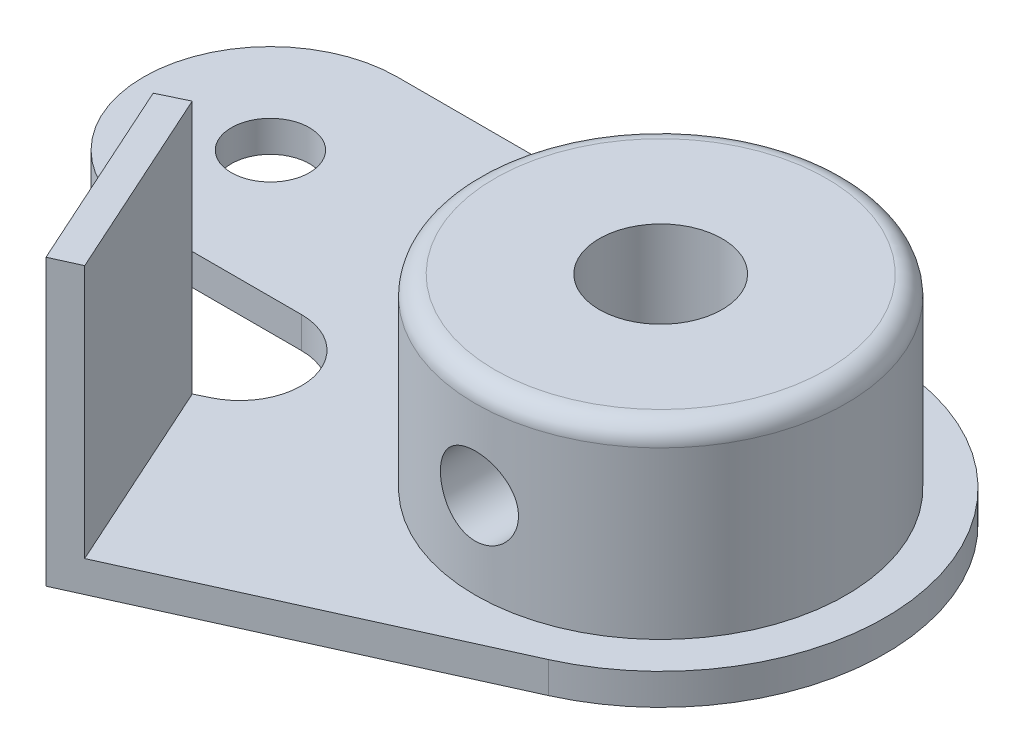
ISO-10303-21;
HEADER;
FILE_DESCRIPTION(('STEP AP214'),'2;1');
FILE_NAME('part.step','',(''),(''),'','','');
FILE_SCHEMA(('AUTOMOTIVE_DESIGN { 1 0 10303 214 1 1 1 1 }'));
ENDSEC;
DATA;
#1=APPLICATION_CONTEXT('core data for automotive mechanical design processes');
#2=APPLICATION_PROTOCOL_DEFINITION('international standard','automotive_design',2000,#1);
#3=PRODUCT_CONTEXT('',#1,'mechanical');
#4=PRODUCT('Part','Part','',(#3));
#5=PRODUCT_RELATED_PRODUCT_CATEGORY('part','',(#4));
#6=PRODUCT_DEFINITION_FORMATION('','',#4);
#7=PRODUCT_DEFINITION_CONTEXT('part definition',#1,'design');
#8=PRODUCT_DEFINITION('design','',#6,#7);
#9=PRODUCT_DEFINITION_SHAPE('','',#8);
#10=(LENGTH_UNIT() NAMED_UNIT(*) SI_UNIT(.MILLI.,.METRE.));
#11=(NAMED_UNIT(*) PLANE_ANGLE_UNIT() SI_UNIT($,.RADIAN.));
#12=(NAMED_UNIT(*) SI_UNIT($,.STERADIAN.) SOLID_ANGLE_UNIT());
#13=UNCERTAINTY_MEASURE_WITH_UNIT(LENGTH_MEASURE(1.E-05),#10,'distance_accuracy_value','');
#14=(GEOMETRIC_REPRESENTATION_CONTEXT(3) GLOBAL_UNCERTAINTY_ASSIGNED_CONTEXT((#13)) GLOBAL_UNIT_ASSIGNED_CONTEXT((#10,
#11,#12)) REPRESENTATION_CONTEXT('',''));
#15=CARTESIAN_POINT('',(0.,0.,0.));
#16=DIRECTION('',(0.,0.,1.));
#17=DIRECTION('',(1.,0.,0.));
#18=AXIS2_PLACEMENT_3D('',#15,#16,#17);
#19=CARTESIAN_POINT('',(0.,1.6,0.));
#20=DIRECTION('',(0.,-1.,0.));
#21=DIRECTION('',(0.,0.,-1.));
#22=AXIS2_PLACEMENT_3D('',#19,#20,#21);
#23=CYLINDRICAL_SURFACE('',#22,3.15);
#24=CARTESIAN_POINT('',(0.,11.1,0.));
#25=DIRECTION('',(0.,1.,0.));
#26=DIRECTION('',(0.,0.,1.));
#27=AXIS2_PLACEMENT_3D('',#24,#25,#26);
#28=CIRCLE('',#27,3.15);
#29=CARTESIAN_POINT('',(0.,11.1,3.15));
#30=VERTEX_POINT('',#29);
#31=EDGE_CURVE('E255',#30,#30,#28,.T.);
#32=ORIENTED_EDGE('',*,*,#31,.T.);
#33=EDGE_LOOP('',(#32));
#34=FACE_BOUND('',#33,.T.);
#35=CARTESIAN_POINT('',(0.,0.,0.));
#36=DIRECTION('',(0.,1.,0.));
#37=DIRECTION('',(0.,0.,1.));
#38=AXIS2_PLACEMENT_3D('',#35,#36,#37);
#39=CIRCLE('',#38,3.15);
#40=CARTESIAN_POINT('',(0.,0.,3.15));
#41=VERTEX_POINT('',#40);
#42=EDGE_CURVE('E148',#41,#41,#39,.T.);
#43=ORIENTED_EDGE('',*,*,#42,.F.);
#44=EDGE_LOOP('',(#43));
#45=FACE_BOUND('',#44,.T.);
#46=CARTESIAN_POINT('',(-2.,6.,2.43361870472759));
#47=CARTESIAN_POINT('',(-1.99999048596303,5.90102207587077,2.43363407140303));
#48=CARTESIAN_POINT('',(-1.99258494171125,5.8019062063151,2.4397712297814));
#49=CARTESIAN_POINT('',(-1.96350941138464,5.60706270821603,2.46321942053438));
#50=CARTESIAN_POINT('',(-1.94180331367139,5.51134430549493,2.48055873835427));
#51=CARTESIAN_POINT('',(-1.88571217682298,5.32670656946432,2.52345220456699));
#52=CARTESIAN_POINT('',(-1.851440143901,5.23773491447205,2.5489328823773));
#53=CARTESIAN_POINT('',(-1.77151743183294,5.06692488180819,2.60511197616351));
#54=CARTESIAN_POINT('',(-1.72586583679141,4.98508707902778,2.6358108120648));
#55=CARTESIAN_POINT('',(-1.61708994740565,4.81836699845349,2.70410628666589));
#56=CARTESIAN_POINT('',(-1.55241882997592,4.73464335498212,2.74206853555775));
#57=CARTESIAN_POINT('',(-1.41059220491435,4.57824562761575,2.81765858361404));
#58=CARTESIAN_POINT('',(-1.33342569379183,4.50558139309569,2.85528605688028));
#59=CARTESIAN_POINT('',(-1.15704034741739,4.36428192092148,2.93157022789516));
#60=CARTESIAN_POINT('',(-1.05626802714094,4.29730784897356,2.96975927399976));
#61=CARTESIAN_POINT('',(-0.841996814394423,4.18181290290956,3.03745228192605));
#62=CARTESIAN_POINT('',(-0.728511029226368,4.13327324596592,3.0669650770146));
#63=CARTESIAN_POINT('',(-0.504499180886491,4.0614865270954,3.11120961521296));
#64=CARTESIAN_POINT('',(-0.394895915515058,4.03613172714355,3.12716069277187));
#65=CARTESIAN_POINT('',(-0.171964548656172,4.00423832870474,3.14728504515542));
#66=CARTESIAN_POINT('',(-0.0586406758425458,3.99767906906348,3.15147125251418));
#67=CARTESIAN_POINT('',(0.151552365513752,4.00337063765575,3.1478620369092));
#68=CARTESIAN_POINT('',(0.248528717658883,4.01314438384651,3.14164430808859));
#69=CARTESIAN_POINT('',(0.439138310744908,4.04640969494782,3.12071260109803));
#70=CARTESIAN_POINT('',(0.532771299038607,4.06990229422963,3.10599798228226));
#71=CARTESIAN_POINT('',(0.71448221653663,4.12952423535327,3.06930433488698));
#72=CARTESIAN_POINT('',(0.802553648932607,4.16566804493043,3.04731699091795));
#73=CARTESIAN_POINT('',(0.971433705071278,4.24922820875193,2.9977610791413));
#74=CARTESIAN_POINT('',(1.05224075549125,4.29664699686879,2.97019130647403));
#75=CARTESIAN_POINT('',(1.21525026488542,4.4081105424623,2.90761365273554));
#76=CARTESIAN_POINT('',(1.29634063387077,4.47349858403209,2.87210613999983));
#77=CARTESIAN_POINT('',(1.44710869319607,4.6155761615265,2.79917994431847));
#78=CARTESIAN_POINT('',(1.51676911567106,4.6922824705496,2.76175847971295));
#79=CARTESIAN_POINT('',(1.65238450119593,4.86708895578629,2.68310715916129));
#80=CARTESIAN_POINT('',(1.71653615599839,4.96668017539723,2.64205458619123));
#81=CARTESIAN_POINT('',(1.82699006644229,5.17767381643497,2.56692053853577));
#82=CARTESIAN_POINT('',(1.87332485499188,5.28905423222767,2.53282641194835));
#83=CARTESIAN_POINT('',(1.93594353840381,5.49006792949197,2.48510313895072));
#84=CARTESIAN_POINT('',(1.95695691453044,5.5775018242823,2.4684365697313));
#85=CARTESIAN_POINT('',(1.98705521670472,5.75558860288065,2.44427838946132));
#86=CARTESIAN_POINT('',(1.99615746158439,5.84623661578726,2.43677345842157));
#87=CARTESIAN_POINT('',(2.00187916764653,6.02845111900768,2.43207683030032));
#88=CARTESIAN_POINT('',(1.99846473948857,6.12001943246775,2.43491313236562));
#89=CARTESIAN_POINT('',(1.97931399694525,6.30102254327303,2.45050151797388));
#90=CARTESIAN_POINT('',(1.96356738826233,6.39045549382134,2.46326188557667));
#91=CARTESIAN_POINT('',(1.92117762173105,6.56283355704784,2.4964515411222));
#92=CARTESIAN_POINT('',(1.89479801639248,6.64588150553575,2.51669442404587));
#93=CARTESIAN_POINT('',(1.83219474854383,6.80653886658106,2.56262885233369));
#94=CARTESIAN_POINT('',(1.79596764397219,6.88414636554851,2.58832230217973));
#95=CARTESIAN_POINT('',(1.70664270614312,7.04769006927012,2.64826132049625));
#96=CARTESIAN_POINT('',(1.65163646925486,7.1323294707201,2.68319953585284));
#97=CARTESIAN_POINT('',(1.52987672919129,7.29212382718042,2.75444460515898));
#98=CARTESIAN_POINT('',(1.46311080446709,7.36726860760888,2.79075287408715));
#99=CARTESIAN_POINT('',(1.30608396864551,7.51922778089847,2.86802362872114));
#100=CARTESIAN_POINT('',(1.21375656890451,7.59407598604232,2.90870266544109));
#101=CARTESIAN_POINT('',(1.01546677917969,7.72715319632718,2.98371307769469));
#102=CARTESIAN_POINT('',(0.909509417054116,7.78538830439131,3.01804678258841));
#103=CARTESIAN_POINT('',(0.692269340715499,7.87990128529792,3.07492813370973));
#104=CARTESIAN_POINT('',(0.581566442490213,7.91717925017158,3.09800396720935));
#105=CARTESIAN_POINT('',(0.353649402796511,7.97195580472325,3.13219438593408));
#106=CARTESIAN_POINT('',(0.236445246049435,7.98948388984159,3.14332680684523));
#107=CARTESIAN_POINT('',(0.0184183325762341,8.00242823691304,3.15154075684456));
#108=CARTESIAN_POINT('',(-0.0821686966634247,8.00081595933269,3.15051062601086));
#109=CARTESIAN_POINT('',(-0.281418451771939,7.98262531510482,3.13898890793604));
#110=CARTESIAN_POINT('',(-0.380081322552779,7.96604807997764,3.12849803603419));
#111=CARTESIAN_POINT('',(-0.568457204796261,7.91986127054207,3.09968712791156));
#112=CARTESIAN_POINT('',(-0.658372613948632,7.89084216408678,3.08172279670887));
#113=CARTESIAN_POINT('',(-0.831943827649842,7.82115957436105,3.03946637750989));
#114=CARTESIAN_POINT('',(-0.915598667382394,7.78049430094183,3.01517331676755));
#115=CARTESIAN_POINT('',(-1.08344928980128,7.68416939821632,2.95926218224012));
#116=CARTESIAN_POINT('',(-1.1668476075888,7.62741068932284,2.92715228253863));
#117=CARTESIAN_POINT('',(-1.32350652343996,7.50278680167161,2.85974121332081));
#118=CARTESIAN_POINT('',(-1.39675588258577,7.43490948882403,2.82443657633822));
#119=CARTESIAN_POINT('',(-1.54245036284827,7.27826060078095,2.74792336709905));
#120=CARTESIAN_POINT('',(-1.61312724346329,7.18788213759843,2.70662345481368));
#121=CARTESIAN_POINT('',(-1.7386221852289,6.99518354718232,2.62777208404518));
#122=CARTESIAN_POINT('',(-1.79344679580487,6.89286837623683,2.59021908172396));
#123=CARTESIAN_POINT('',(-1.87534108446168,6.70106788875551,2.53131778643174));
#124=CARTESIAN_POINT('',(-1.90584854100258,6.61358965355608,2.50822135269557));
#125=CARTESIAN_POINT('',(-1.95462246620744,6.4336753141246,2.47040933014862));
#126=CARTESIAN_POINT('',(-1.97292616984275,6.34125522889024,2.45566826901342));
#127=CARTESIAN_POINT('',(-1.98972501700962,6.20664950465987,2.44203397681219));
#128=CARTESIAN_POINT('',(-1.99357048045008,6.16548905913659,2.43889105725654));
#129=CARTESIAN_POINT('',(-1.99871031223206,6.08289385786258,2.43467992010628));
#130=CARTESIAN_POINT('',(-2.00000398515883,6.04145903042309,2.43361226806538));
#131=CARTESIAN_POINT('',(-2.,6.,2.43361870472759));
#132=B_SPLINE_CURVE_WITH_KNOTS('',3,(#46,#47,#48,#49,#50,#51,#52,#53,#54,#55,#56,#57,#58,#59,
#60,#61,#62,#63,#64,#65,#66,#67,#68,#69,#70,#71,#72,#73,#74,#75,#76,#77,#78,#79,#80,#81,#82,#83,
#84,#85,#86,#87,#88,#89,#90,#91,#92,#93,#94,#95,#96,#97,#98,#99,#100,#101,#102,#103,#104,#105,
#106,#107,#108,#109,#110,#111,#112,#113,#114,#115,#116,#117,#118,#119,#120,#121,#122,#123,#124,
#125,#126,#127,#128,#129,#130,#131),.UNSPECIFIED.,.T.,.F.,(4,2,2,2,2,2,2,2,2,2,2,2,2,2,2,2,2,2,
2,2,2,2,2,2,2,2,2,2,2,2,2,2,2,2,2,2,2,2,2,2,2,2,4),(0.,0.296743535927673,0.594239293109833,
0.889122768316478,1.18402998518316,1.51993870440622,1.85614485104264,2.23471138765325,
2.61289116127746,2.95168264677021,3.29010156976508,3.5816951499518,3.87331071849013,
4.16526086971039,4.45727410003803,4.78615817426407,5.11553462634661,5.48986491382257,
5.86350840566245,6.13674202691223,6.4095779223354,6.68315307564917,6.95695683976678,
7.22435474797716,7.49184624200051,7.81112947271864,8.13075200158783,8.50574828386312,
8.88060663103731,9.2355988873744,9.59006027521556,9.89031729141086,10.1905516066751,
10.4778877674234,10.7652681187458,11.0816516893217,11.398382868429,11.762616691235,
12.1266998137276,12.4120863063782,12.6965980198832,12.8208615668584,12.9451589734985),.UNSPECIFIED.);
#133=CARTESIAN_POINT('',(-2.,6.,2.43361870472759));
#134=VERTEX_POINT('',#133);
#135=EDGE_CURVE('E208',#134,#134,#132,.T.);
#136=ORIENTED_EDGE('',*,*,#135,.T.);
#137=EDGE_LOOP('',(#136));
#138=FACE_BOUND('',#137,.T.);
#139=ADVANCED_FACE('F34',(#34,#45,#138),#23,.F.);
#140=CARTESIAN_POINT('',(0.,11.1,0.));
#141=DIRECTION('',(0.,-1.,0.));
#142=DIRECTION('',(0.,0.,-1.));
#143=AXIS2_PLACEMENT_3D('',#140,#141,#142);
#144=CYLINDRICAL_SURFACE('',#143,9.5);
#145=CARTESIAN_POINT('',(0.,1.6,0.));
#146=DIRECTION('',(0.,1.,0.));
#147=DIRECTION('',(0.,0.,1.));
#148=AXIS2_PLACEMENT_3D('',#145,#146,#147);
#149=CIRCLE('',#148,9.5);
#150=CARTESIAN_POINT('',(0.,1.6,9.5));
#151=VERTEX_POINT('',#150);
#152=EDGE_CURVE('E257',#151,#151,#149,.T.);
#153=ORIENTED_EDGE('',*,*,#152,.T.);
#154=EDGE_LOOP('',(#153));
#155=FACE_BOUND('',#154,.T.);
#156=CARTESIAN_POINT('',(0.,10.1,0.));
#157=DIRECTION('',(0.,1.,0.));
#158=DIRECTION('',(0.,0.,1.));
#159=AXIS2_PLACEMENT_3D('',#156,#157,#158);
#160=CIRCLE('',#159,9.5);
#161=CARTESIAN_POINT('',(0.,10.1,9.5));
#162=VERTEX_POINT('',#161);
#163=EDGE_CURVE('E11',#162,#162,#160,.F.);
#164=ORIENTED_EDGE('',*,*,#163,.T.);
#165=EDGE_LOOP('',(#164));
#166=FACE_BOUND('',#165,.T.);
#167=CARTESIAN_POINT('',(-2.,6.,9.28708781050335));
#168=CARTESIAN_POINT('',(-1.99999604848787,5.88900304503224,9.28709004628219));
#169=CARTESIAN_POINT('',(-1.99072834902824,5.77795759481624,9.28909937908883));
#170=CARTESIAN_POINT('',(-1.95393863409866,5.55901720556999,9.29690617273113));
#171=CARTESIAN_POINT('',(-1.92640279098501,5.45112471773798,9.30270650302418));
#172=CARTESIAN_POINT('',(-1.85397609005222,5.24168916970608,9.31740991810553));
#173=CARTESIAN_POINT('',(-1.80910347426968,5.14013956545724,9.32630974059008));
#174=CARTESIAN_POINT('',(-1.7033282235525,4.94600997855492,9.34620545074923));
#175=CARTESIAN_POINT('',(-1.64242617036495,4.85342967055075,9.35720126235131));
#176=CARTESIAN_POINT('',(-1.50530439177798,4.67841419795608,9.38024234347676));
#177=CARTESIAN_POINT('',(-1.42888140265771,4.59613991627309,9.39230019123638));
#178=CARTESIAN_POINT('',(-1.26332609209004,4.44547897146353,9.4159963506712));
#179=CARTESIAN_POINT('',(-1.17419282797262,4.37709333931506,9.42763463114851));
#180=CARTESIAN_POINT('',(-0.984674376392206,4.2555199104585,9.44931673722958));
#181=CARTESIAN_POINT('',(-0.884188396563354,4.20248602834388,9.45934399483539));
#182=CARTESIAN_POINT('',(-0.675484795669487,4.11411614706986,9.47653252407335));
#183=CARTESIAN_POINT('',(-0.567267978748515,4.0787783102621,9.4836940932778));
#184=CARTESIAN_POINT('',(-0.347846036008974,4.02730732607637,9.49425545534837));
#185=CARTESIAN_POINT('',(-0.236707324826062,4.01090215762969,9.49770848039411));
#186=CARTESIAN_POINT('',(-0.0132051123854741,3.99691250420025,9.50064786364403));
#187=CARTESIAN_POINT('',(0.0991582573863645,3.99932601823939,9.50013464357649));
#188=CARTESIAN_POINT('',(0.320047679053737,4.02270095354995,9.49524029898523));
#189=CARTESIAN_POINT('',(0.428606301711607,4.04336925938677,9.49092030201756));
#190=CARTESIAN_POINT('',(0.640679021827895,4.10220096475522,9.47896712250148));
#191=CARTESIAN_POINT('',(0.744192902346073,4.14036511593169,9.47133379760883));
#192=CARTESIAN_POINT('',(0.944061522506243,4.23336992068646,9.45351224173596));
#193=CARTESIAN_POINT('',(1.04036218955075,4.2883233476939,9.44330681774517));
#194=CARTESIAN_POINT('',(1.22248275831773,4.41326298165436,9.42146280046143));
#195=CARTESIAN_POINT('',(1.3083013288483,4.48325109485608,9.40982402551375));
#196=CARTESIAN_POINT('',(1.46876329697693,4.63787472649073,9.38613072324991));
#197=CARTESIAN_POINT('',(1.54315914177499,4.72276679196659,9.37407250702203));
#198=CARTESIAN_POINT('',(1.67670206801193,4.9039456591447,9.35111090453841));
#199=CARTESIAN_POINT('',(1.7358487951699,5.0002327255098,9.34020754511678));
#200=CARTESIAN_POINT('',(1.83731339767347,5.20184847332234,9.32078149698533));
#201=CARTESIAN_POINT('',(1.87958750888871,5.30719981726704,9.31226501615453));
#202=CARTESIAN_POINT('',(1.94575946786075,5.52373196028862,9.29866512008386));
#203=CARTESIAN_POINT('',(1.96965999511226,5.6349119068295,9.29358120427221));
#204=CARTESIAN_POINT('',(1.99802865644981,5.85769147859025,9.28752335798651));
#205=CARTESIAN_POINT('',(2.00285591352628,5.96924336038486,9.28647348271892));
#206=CARTESIAN_POINT('',(1.99391064101408,6.19155809697597,9.28839817637478));
#207=CARTESIAN_POINT('',(1.98013928830147,6.30232100125126,9.29137249065704));
#208=CARTESIAN_POINT('',(1.93469842503013,6.51868268885267,9.30093898330961));
#209=CARTESIAN_POINT('',(1.90322405334428,6.62432436069352,9.30749169477901));
#210=CARTESIAN_POINT('',(1.82348069481082,6.8288348599648,9.3234415006778));
#211=CARTESIAN_POINT('',(1.77521019922931,6.92770307800561,9.33283885062072));
#212=CARTESIAN_POINT('',(1.66244389822715,7.11742204904986,9.35358763018115));
#213=CARTESIAN_POINT('',(1.59772530294085,7.20813746782993,9.36496515398555));
#214=CARTESIAN_POINT('',(1.45419387760045,7.37755186309328,9.3883222729422));
#215=CARTESIAN_POINT('',(1.37537943217288,7.45624946042531,9.40030193698601));
#216=CARTESIAN_POINT('',(1.20427422366582,7.60077369310916,9.42376214796692));
#217=CARTESIAN_POINT('',(1.11177548384634,7.66635638836808,9.43523060826274));
#218=CARTESIAN_POINT('',(0.916864851897604,7.78105109964109,9.45615945157325));
#219=CARTESIAN_POINT('',(0.814453403517883,7.83016385250499,9.46561992441647));
#220=CARTESIAN_POINT('',(0.603236849515161,7.91017768961087,9.48141559299094));
#221=CARTESIAN_POINT('',(0.494474988160274,7.94118903265177,9.48776967094203));
#222=CARTESIAN_POINT('',(0.27313749393954,7.98446646399412,9.4967179724302));
#223=CARTESIAN_POINT('',(0.160562374707103,7.99673506669941,9.49931270029477));
#224=CARTESIAN_POINT('',(-0.0628839753092441,8.00207270246148,9.5004363371801));
#225=CARTESIAN_POINT('',(-0.173746249878784,7.99550706519932,9.49904261190113));
#226=CARTESIAN_POINT('',(-0.39274965005591,7.96417504266881,9.49251031027347));
#227=CARTESIAN_POINT('',(-0.500890817726433,7.93940893892269,9.48737179184874));
#228=CARTESIAN_POINT('',(-0.711124238714222,7.87254850892344,9.47393142103355));
#229=CARTESIAN_POINT('',(-0.813232448267794,7.8305024696315,9.4656383883706));
#230=CARTESIAN_POINT('',(-1.00899513608219,7.73032420845376,9.4467778146525));
#231=CARTESIAN_POINT('',(-1.10264885939459,7.67219055189517,9.43621007076024));
#232=CARTESIAN_POINT('',(-1.28063720637341,7.54027755077572,9.41372230018547));
#233=CARTESIAN_POINT('',(-1.36477733307988,7.46623926644881,9.40178163275772));
#234=CARTESIAN_POINT('',(-1.519564324803,7.30514544182159,9.37800998504355));
#235=CARTESIAN_POINT('',(-1.59020796110607,7.21808679556831,9.36617903164606));
#236=CARTESIAN_POINT('',(-1.71682094415388,7.03214912730494,9.34380655671436));
#237=CARTESIAN_POINT('',(-1.77260102752215,6.93313901867487,9.33328250045813));
#238=CARTESIAN_POINT('',(-1.86664264117731,6.72695301236312,9.31493203835597));
#239=CARTESIAN_POINT('',(-1.90491947935911,6.61978434601925,9.30710327676031));
#240=CARTESIAN_POINT('',(-1.95576882435574,6.42703729981974,9.29652930127854));
#241=CARTESIAN_POINT('',(-1.97232467609379,6.34252956133883,9.29301153387582));
#242=CARTESIAN_POINT('',(-1.99444156473289,6.17202421689418,9.28828997058716));
#243=CARTESIAN_POINT('',(-2.00000306256549,6.08602667354209,9.28708607769352));
#244=CARTESIAN_POINT('',(-2.,6.,9.28708781050335));
#245=B_SPLINE_CURVE_WITH_KNOTS('',3,(#167,#168,#169,#170,#171,#172,#173,#174,#175,#176,#177,
#178,#179,#180,#181,#182,#183,#184,#185,#186,#187,#188,#189,#190,#191,#192,#193,#194,#195,#196,
#197,#198,#199,#200,#201,#202,#203,#204,#205,#206,#207,#208,#209,#210,#211,#212,#213,#214,#215,
#216,#217,#218,#219,#220,#221,#222,#223,#224,#225,#226,#227,#228,#229,#230,#231,#232,#233,#234,
#235,#236,#237,#238,#239,#240,#241,#242,#243,#244),.UNSPECIFIED.,.T.,.F.,(4,2,2,2,2,2,2,2,2,2,2,
2,2,2,2,2,2,2,2,2,2,2,2,2,2,2,2,2,2,2,2,2,2,2,2,2,2,2,4),(0.,0.332675720034056,0.66560353890375,
0.998181995545641,1.33074838377397,1.66798910536293,2.00525485176212,2.34579332468104,
2.68629642699646,3.02184382391206,3.3573555427809,3.68757597677536,4.01781059880938,
4.35031407759778,4.68285973942978,5.02182136111628,5.36079085714758,5.70063394463758,
6.04042746201684,6.37379176148539,6.70713496743751,7.03687380782473,7.36664227508609,
7.70114062330744,8.03567732937095,8.37595255086767,8.71621254673811,9.05437772891384,
9.39249754106857,9.72410341466951,10.0557041591458,10.3863845135479,10.7170943671025,
11.0536632320287,11.3903125124892,11.7310632155782,12.0715153340735,12.3293619162638,
12.5871976881646),.UNSPECIFIED.);
#246=CARTESIAN_POINT('',(-2.,6.,9.28708781050335));
#247=VERTEX_POINT('',#246);
#248=EDGE_CURVE('E38',#247,#247,#245,.T.);
#249=ORIENTED_EDGE('',*,*,#248,.F.);
#250=EDGE_LOOP('',(#249));
#251=FACE_BOUND('',#250,.T.);
#252=ADVANCED_FACE('F194',(#155,#166,#251),#144,.T.);
#253=CARTESIAN_POINT('',(0.,1.6,0.));
#254=DIRECTION('',(0.,1.,0.));
#255=DIRECTION('',(0.,0.,1.));
#256=AXIS2_PLACEMENT_3D('',#253,#254,#255);
#257=PLANE('',#256);
#258=ORIENTED_EDGE('',*,*,#152,.F.);
#259=EDGE_LOOP('',(#258));
#260=FACE_BOUND('',#259,.T.);
#261=CARTESIAN_POINT('',(-25.,1.6,-4.99999999999999));
#262=DIRECTION('',(0.,1.,0.));
#263=DIRECTION('',(0.,0.,1.));
#264=AXIS2_PLACEMENT_3D('',#261,#262,#263);
#265=CIRCLE('',#264,2.);
#266=CARTESIAN_POINT('',(-25.,1.6,-2.99999999999999));
#267=VERTEX_POINT('',#266);
#268=EDGE_CURVE('E261',#267,#267,#265,.T.);
#269=ORIENTED_EDGE('',*,*,#268,.F.);
#270=EDGE_LOOP('',(#269));
#271=FACE_BOUND('',#270,.T.);
#272=DIRECTION('',(-0.90028530187311,0.,0.435300327625931));
#273=VECTOR('',#272,1.);
#274=CARTESIAN_POINT('',(-15.5324639510125,1.6,7.51015998222599));
#275=LINE('',#274,#273);
#276=CARTESIAN_POINT('',(-15.5324639510125,1.6,7.51015998222599));
#277=VERTEX_POINT('',#276);
#278=CARTESIAN_POINT('',(-16.1820359982028,1.6,7.82423700244424));
#279=VERTEX_POINT('',#278);
#280=EDGE_CURVE('E55',#277,#279,#275,.T.);
#281=ORIENTED_EDGE('',*,*,#280,.T.);
#282=DIRECTION('',(-0.412042177364769,0.,-0.911164773283351));
#283=VECTOR('',#282,1.);
#284=CARTESIAN_POINT('',(-16.1820359982028,1.6,7.82423700244424));
#285=LINE('',#284,#283);
#286=CARTESIAN_POINT('',(-11.6337033913184,1.6,17.8821404798842));
#287=VERTEX_POINT('',#286);
#288=EDGE_CURVE('E214',#287,#279,#285,.T.);
#289=ORIENTED_EDGE('',*,*,#288,.F.);
#290=DIRECTION('',(0.911164773283351,0.,-0.412042177364769));
#291=VECTOR('',#290,1.);
#292=CARTESIAN_POINT('',(4.73848503969484,1.6,10.4783948927585));
#293=LINE('',#292,#291);
#294=CARTESIAN_POINT('',(4.73848503969484,1.6,10.4783948927585));
#295=VERTEX_POINT('',#294);
#296=EDGE_CURVE('E62',#287,#295,#293,.T.);
#297=ORIENTED_EDGE('',*,*,#296,.T.);
#298=CARTESIAN_POINT('',(0.,1.6,0.));
#299=DIRECTION('',(0.,1.,0.));
#300=DIRECTION('',(0.,0.,1.));
#301=AXIS2_PLACEMENT_3D('',#298,#299,#300);
#302=CIRCLE('',#301,11.5);
#303=CARTESIAN_POINT('',(0.,1.6,-11.5));
#304=VERTEX_POINT('',#303);
#305=EDGE_CURVE('E160',#295,#304,#302,.T.);
#306=ORIENTED_EDGE('',*,*,#305,.T.);
#307=DIRECTION('',(-1.,0.,0.));
#308=VECTOR('',#307,1.);
#309=CARTESIAN_POINT('',(0.,1.6,-11.5));
#310=LINE('',#309,#308);
#311=CARTESIAN_POINT('',(-25.,1.6,-11.5));
#312=VERTEX_POINT('',#311);
#313=EDGE_CURVE('E104',#304,#312,#310,.T.);
#314=ORIENTED_EDGE('',*,*,#313,.T.);
#315=CARTESIAN_POINT('',(-25.,1.6,-4.99999999999999));
#316=DIRECTION('',(0.,1.,0.));
#317=DIRECTION('',(0.,0.,1.));
#318=AXIS2_PLACEMENT_3D('',#315,#316,#317);
#319=CIRCLE('',#318,6.50000000000001);
#320=CARTESIAN_POINT('',(-25.,1.6,1.50000000000001));
#321=VERTEX_POINT('',#320);
#322=EDGE_CURVE('E121',#312,#321,#319,.T.);
#323=ORIENTED_EDGE('',*,*,#322,.T.);
#324=DIRECTION('',(1.,0.,0.));
#325=VECTOR('',#324,1.);
#326=CARTESIAN_POINT('',(-25.,1.6,1.50000000000001));
#327=LINE('',#326,#325);
#328=CARTESIAN_POINT('',(-16.9092175399438,1.6,1.50000000000001));
#329=VERTEX_POINT('',#328);
#330=EDGE_CURVE('E114',#321,#329,#327,.T.);
#331=ORIENTED_EDGE('',*,*,#330,.T.);
#332=CARTESIAN_POINT('',(-16.9092175399438,1.6,4.66276717832938));
#333=DIRECTION('',(0.,-1.,0.));
#334=DIRECTION('',(0.,0.,-1.));
#335=AXIS2_PLACEMENT_3D('',#332,#333,#334);
#336=CIRCLE('',#335,3.16276717832936);
#337=EDGE_CURVE('E118',#329,#277,#336,.T.);
#338=ORIENTED_EDGE('',*,*,#337,.T.);
#339=EDGE_LOOP('',(#281,#289,#297,#306,#314,#323,#331,#338));
#340=FACE_BOUND('',#339,.T.);
#341=ADVANCED_FACE('F116',(#260,#271,#340),#257,.T.);
#342=CARTESIAN_POINT('',(0.,0.,0.));
#343=DIRECTION('',(0.,1.,0.));
#344=DIRECTION('',(0.,0.,1.));
#345=AXIS2_PLACEMENT_3D('',#342,#343,#344);
#346=PLANE('',#345);
#347=ORIENTED_EDGE('',*,*,#42,.T.);
#348=EDGE_LOOP('',(#347));
#349=FACE_BOUND('',#348,.T.);
#350=CARTESIAN_POINT('',(0.,0.,0.));
#351=DIRECTION('',(0.,1.,0.));
#352=DIRECTION('',(0.,0.,1.));
#353=AXIS2_PLACEMENT_3D('',#350,#351,#352);
#354=CIRCLE('',#353,11.5);
#355=CARTESIAN_POINT('',(4.73848503969484,0.,10.4783948927585));
#356=VERTEX_POINT('',#355);
#357=CARTESIAN_POINT('',(0.,0.,-11.5));
#358=VERTEX_POINT('',#357);
#359=EDGE_CURVE('E144',#356,#358,#354,.T.);
#360=ORIENTED_EDGE('',*,*,#359,.F.);
#361=DIRECTION('',(0.911164773283351,0.,-0.412042177364769));
#362=VECTOR('',#361,1.);
#363=CARTESIAN_POINT('',(4.73848503969484,0.,10.4783948927585));
#364=LINE('',#363,#362);
#365=CARTESIAN_POINT('',(-13.,0.,18.5));
#366=VERTEX_POINT('',#365);
#367=EDGE_CURVE('E95',#366,#356,#364,.T.);
#368=ORIENTED_EDGE('',*,*,#367,.F.);
#369=DIRECTION('',(0.412042177364769,0.,0.911164773283351));
#370=VECTOR('',#369,1.);
#371=CARTESIAN_POINT('',(-17.5324639510125,0.,8.47718749388314));
#372=LINE('',#371,#370);
#373=CARTESIAN_POINT('',(-17.5324639510125,0.,8.47718749388314));
#374=VERTEX_POINT('',#373);
#375=EDGE_CURVE('E157',#374,#366,#372,.T.);
#376=ORIENTED_EDGE('',*,*,#375,.F.);
#377=DIRECTION('',(-0.90028530187311,0.,0.435300327625931));
#378=VECTOR('',#377,1.);
#379=CARTESIAN_POINT('',(-15.5324639510125,0.,7.51015998222599));
#380=LINE('',#379,#378);
#381=CARTESIAN_POINT('',(-15.5324639510125,0.,7.51015998222599));
#382=VERTEX_POINT('',#381);
#383=EDGE_CURVE('E155',#382,#374,#380,.T.);
#384=ORIENTED_EDGE('',*,*,#383,.F.);
#385=CARTESIAN_POINT('',(-16.9092175399438,0.,4.66276717832938));
#386=DIRECTION('',(0.,-1.,0.));
#387=DIRECTION('',(0.,0.,-1.));
#388=AXIS2_PLACEMENT_3D('',#385,#386,#387);
#389=CIRCLE('',#388,3.16276717832936);
#390=CARTESIAN_POINT('',(-16.9092175399438,0.,1.50000000000001));
#391=VERTEX_POINT('',#390);
#392=EDGE_CURVE('E153',#391,#382,#389,.T.);
#393=ORIENTED_EDGE('',*,*,#392,.F.);
#394=DIRECTION('',(1.,0.,0.));
#395=VECTOR('',#394,1.);
#396=CARTESIAN_POINT('',(-25.,0.,1.50000000000001));
#397=LINE('',#396,#395);
#398=CARTESIAN_POINT('',(-25.,0.,1.50000000000001));
#399=VERTEX_POINT('',#398);
#400=EDGE_CURVE('E130',#399,#391,#397,.T.);
#401=ORIENTED_EDGE('',*,*,#400,.F.);
#402=CARTESIAN_POINT('',(-25.,0.,-4.99999999999999));
#403=DIRECTION('',(0.,1.,0.));
#404=DIRECTION('',(0.,0.,1.));
#405=AXIS2_PLACEMENT_3D('',#402,#403,#404);
#406=CIRCLE('',#405,6.50000000000001);
#407=CARTESIAN_POINT('',(-25.,0.,-11.5));
#408=VERTEX_POINT('',#407);
#409=EDGE_CURVE('E150',#408,#399,#406,.T.);
#410=ORIENTED_EDGE('',*,*,#409,.F.);
#411=DIRECTION('',(-1.,0.,0.));
#412=VECTOR('',#411,1.);
#413=CARTESIAN_POINT('',(0.,0.,-11.5));
#414=LINE('',#413,#412);
#415=EDGE_CURVE('E147',#358,#408,#414,.T.);
#416=ORIENTED_EDGE('',*,*,#415,.F.);
#417=EDGE_LOOP('',(#360,#368,#376,#384,#393,#401,#410,#416));
#418=FACE_BOUND('',#417,.T.);
#419=CARTESIAN_POINT('',(-25.,0.,-4.99999999999999));
#420=DIRECTION('',(0.,1.,0.));
#421=DIRECTION('',(0.,0.,1.));
#422=AXIS2_PLACEMENT_3D('',#419,#420,#421);
#423=CIRCLE('',#422,2.);
#424=CARTESIAN_POINT('',(-25.,0.,-2.99999999999999));
#425=VERTEX_POINT('',#424);
#426=EDGE_CURVE('E260',#425,#425,#423,.T.);
#427=ORIENTED_EDGE('',*,*,#426,.T.);
#428=EDGE_LOOP('',(#427));
#429=FACE_BOUND('',#428,.T.);
#430=ADVANCED_FACE('F277',(#349,#418,#429),#346,.F.);
#431=CARTESIAN_POINT('',(0.,1.6,0.));
#432=DIRECTION('',(0.,-1.,0.));
#433=DIRECTION('',(0.,0.,-1.));
#434=AXIS2_PLACEMENT_3D('',#431,#432,#433);
#435=CYLINDRICAL_SURFACE('',#434,11.5);
#436=ORIENTED_EDGE('',*,*,#359,.T.);
#437=DIRECTION('',(0.,-1.,0.));
#438=VECTOR('',#437,1.);
#439=CARTESIAN_POINT('',(0.,1.6,-11.5));
#440=LINE('',#439,#438);
#441=EDGE_CURVE('E172',#304,#358,#440,.T.);
#442=ORIENTED_EDGE('',*,*,#441,.F.);
#443=ORIENTED_EDGE('',*,*,#305,.F.);
#444=DIRECTION('',(0.,-1.,0.));
#445=VECTOR('',#444,1.);
#446=CARTESIAN_POINT('',(4.73848503969484,1.6,10.4783948927585));
#447=LINE('',#446,#445);
#448=EDGE_CURVE('E143',#295,#356,#447,.T.);
#449=ORIENTED_EDGE('',*,*,#448,.T.);
#450=EDGE_LOOP('',(#436,#442,#443,#449));
#451=FACE_BOUND('',#450,.T.);
#452=ADVANCED_FACE('F291',(#451),#435,.T.);
#453=CARTESIAN_POINT('',(0.,1.6,-11.5));
#454=DIRECTION('',(0.,0.,1.));
#455=DIRECTION('',(1.,0.,0.));
#456=AXIS2_PLACEMENT_3D('',#453,#454,#455);
#457=PLANE('',#456);
#458=ORIENTED_EDGE('',*,*,#415,.T.);
#459=DIRECTION('',(0.,-1.,0.));
#460=VECTOR('',#459,1.);
#461=CARTESIAN_POINT('',(-25.,1.6,-11.5));
#462=LINE('',#461,#460);
#463=EDGE_CURVE('E169',#312,#408,#462,.T.);
#464=ORIENTED_EDGE('',*,*,#463,.F.);
#465=ORIENTED_EDGE('',*,*,#313,.F.);
#466=ORIENTED_EDGE('',*,*,#441,.T.);
#467=EDGE_LOOP('',(#458,#464,#465,#466));
#468=FACE_BOUND('',#467,.T.);
#469=ADVANCED_FACE('F271',(#468),#457,.F.);
#470=CARTESIAN_POINT('',(-25.,1.6,-4.99999999999999));
#471=DIRECTION('',(0.,-1.,0.));
#472=DIRECTION('',(0.,0.,-1.));
#473=AXIS2_PLACEMENT_3D('',#470,#471,#472);
#474=CYLINDRICAL_SURFACE('',#473,6.50000000000001);
#475=ORIENTED_EDGE('',*,*,#409,.T.);
#476=DIRECTION('',(0.,-1.,0.));
#477=VECTOR('',#476,1.);
#478=CARTESIAN_POINT('',(-25.,1.6,1.50000000000001));
#479=LINE('',#478,#477);
#480=EDGE_CURVE('E133',#321,#399,#479,.T.);
#481=ORIENTED_EDGE('',*,*,#480,.F.);
#482=ORIENTED_EDGE('',*,*,#322,.F.);
#483=ORIENTED_EDGE('',*,*,#463,.T.);
#484=EDGE_LOOP('',(#475,#481,#482,#483));
#485=FACE_BOUND('',#484,.T.);
#486=ADVANCED_FACE('F274',(#485),#474,.T.);
#487=CARTESIAN_POINT('',(-25.,1.6,1.50000000000001));
#488=DIRECTION('',(0.,0.,-1.));
#489=DIRECTION('',(-1.,0.,0.));
#490=AXIS2_PLACEMENT_3D('',#487,#488,#489);
#491=PLANE('',#490);
#492=ORIENTED_EDGE('',*,*,#400,.T.);
#493=DIRECTION('',(0.,-1.,0.));
#494=VECTOR('',#493,1.);
#495=CARTESIAN_POINT('',(-16.9092175399438,1.6,1.50000000000001));
#496=LINE('',#495,#494);
#497=EDGE_CURVE('E127',#329,#391,#496,.T.);
#498=ORIENTED_EDGE('',*,*,#497,.F.);
#499=ORIENTED_EDGE('',*,*,#330,.F.);
#500=ORIENTED_EDGE('',*,*,#480,.T.);
#501=EDGE_LOOP('',(#492,#498,#499,#500));
#502=FACE_BOUND('',#501,.T.);
#503=ADVANCED_FACE('F128',(#502),#491,.F.);
#504=CARTESIAN_POINT('',(-16.9092175399438,1.6,4.66276717832938));
#505=DIRECTION('',(0.,-1.,0.));
#506=DIRECTION('',(0.,0.,-1.));
#507=AXIS2_PLACEMENT_3D('',#504,#505,#506);
#508=CYLINDRICAL_SURFACE('',#507,3.16276717832936);
#509=ORIENTED_EDGE('',*,*,#392,.T.);
#510=DIRECTION('',(0.,-1.,0.));
#511=VECTOR('',#510,1.);
#512=CARTESIAN_POINT('',(-15.5324639510125,1.6,7.51015998222599));
#513=LINE('',#512,#511);
#514=EDGE_CURVE('E134',#277,#382,#513,.T.);
#515=ORIENTED_EDGE('',*,*,#514,.F.);
#516=ORIENTED_EDGE('',*,*,#337,.F.);
#517=ORIENTED_EDGE('',*,*,#497,.T.);
#518=EDGE_LOOP('',(#509,#515,#516,#517));
#519=FACE_BOUND('',#518,.T.);
#520=ADVANCED_FACE('F136',(#519),#508,.F.);
#521=CARTESIAN_POINT('',(-15.5324639510125,1.6,7.51015998222599));
#522=DIRECTION('',(0.435300327625931,0.,0.90028530187311));
#523=DIRECTION('',(0.90028530187311,0.,-0.435300327625931));
#524=AXIS2_PLACEMENT_3D('',#521,#522,#523);
#525=PLANE('',#524);
#526=ORIENTED_EDGE('',*,*,#383,.T.);
#527=DIRECTION('',(0.,-1.,0.));
#528=VECTOR('',#527,1.);
#529=CARTESIAN_POINT('',(-17.5324639510125,1.6,8.47718749388314));
#530=LINE('',#529,#528);
#531=CARTESIAN_POINT('',(-17.5324639510125,14.6,8.47718749388314));
#532=VERTEX_POINT('',#531);
#533=EDGE_CURVE('E164',#532,#374,#530,.T.);
#534=ORIENTED_EDGE('',*,*,#533,.F.);
#535=DIRECTION('',(-0.90028530187311,0.,0.435300327625931));
#536=VECTOR('',#535,1.);
#537=CARTESIAN_POINT('',(-16.1820359982028,14.6,7.82423700244424));
#538=LINE('',#537,#536);
#539=CARTESIAN_POINT('',(-16.1820359982028,14.6,7.82423700244424));
#540=VERTEX_POINT('',#539);
#541=EDGE_CURVE('E215',#540,#532,#538,.T.);
#542=ORIENTED_EDGE('',*,*,#541,.F.);
#543=DIRECTION('',(0.,-1.,0.));
#544=VECTOR('',#543,1.);
#545=CARTESIAN_POINT('',(-16.1820359982028,14.6,7.82423700244424));
#546=LINE('',#545,#544);
#547=EDGE_CURVE('E251',#540,#279,#546,.T.);
#548=ORIENTED_EDGE('',*,*,#547,.T.);
#549=ORIENTED_EDGE('',*,*,#280,.F.);
#550=ORIENTED_EDGE('',*,*,#514,.T.);
#551=EDGE_LOOP('',(#526,#534,#542,#548,#549,#550));
#552=FACE_BOUND('',#551,.T.);
#553=ADVANCED_FACE('F281',(#552),#525,.F.);
#554=CARTESIAN_POINT('',(-17.5324639510125,1.6,8.47718749388314));
#555=DIRECTION('',(0.911164773283351,0.,-0.412042177364769));
#556=DIRECTION('',(-0.412042177364769,0.,-0.911164773283351));
#557=AXIS2_PLACEMENT_3D('',#554,#555,#556);
#558=PLANE('',#557);
#559=ORIENTED_EDGE('',*,*,#375,.T.);
#560=DIRECTION('',(0.,-1.,0.));
#561=VECTOR('',#560,1.);
#562=CARTESIAN_POINT('',(-13.,1.6,18.5));
#563=LINE('',#562,#561);
#564=CARTESIAN_POINT('',(-13.,14.6,18.5));
#565=VERTEX_POINT('',#564);
#566=EDGE_CURVE('E162',#565,#366,#563,.T.);
#567=ORIENTED_EDGE('',*,*,#566,.F.);
#568=DIRECTION('',(0.412042177364769,0.,0.911164773283351));
#569=VECTOR('',#568,1.);
#570=CARTESIAN_POINT('',(-17.5324639510125,14.6,8.47718749388314));
#571=LINE('',#570,#569);
#572=EDGE_CURVE('E236',#532,#565,#571,.T.);
#573=ORIENTED_EDGE('',*,*,#572,.F.);
#574=ORIENTED_EDGE('',*,*,#533,.T.);
#575=EDGE_LOOP('',(#559,#567,#573,#574));
#576=FACE_BOUND('',#575,.T.);
#577=ADVANCED_FACE('F287',(#576),#558,.F.);
#578=CARTESIAN_POINT('',(4.73848503969484,1.6,10.4783948927585));
#579=DIRECTION('',(-0.412042177364769,0.,-0.911164773283351));
#580=DIRECTION('',(-0.911164773283351,0.,0.412042177364769));
#581=AXIS2_PLACEMENT_3D('',#578,#579,#580);
#582=PLANE('',#581);
#583=ORIENTED_EDGE('',*,*,#367,.T.);
#584=ORIENTED_EDGE('',*,*,#448,.F.);
#585=ORIENTED_EDGE('',*,*,#296,.F.);
#586=DIRECTION('',(0.,-1.,0.));
#587=VECTOR('',#586,1.);
#588=CARTESIAN_POINT('',(-11.6337033913184,14.6,17.8821404798842));
#589=LINE('',#588,#587);
#590=CARTESIAN_POINT('',(-11.6337033913184,14.6,17.8821404798842));
#591=VERTEX_POINT('',#590);
#592=EDGE_CURVE('E253',#591,#287,#589,.T.);
#593=ORIENTED_EDGE('',*,*,#592,.F.);
#594=DIRECTION('',(0.911164773283351,0.,-0.412042177364768));
#595=VECTOR('',#594,1.);
#596=CARTESIAN_POINT('',(-13.,14.6,18.5));
#597=LINE('',#596,#595);
#598=EDGE_CURVE('E245',#565,#591,#597,.T.);
#599=ORIENTED_EDGE('',*,*,#598,.F.);
#600=ORIENTED_EDGE('',*,*,#566,.T.);
#601=EDGE_LOOP('',(#583,#584,#585,#593,#599,#600));
#602=FACE_BOUND('',#601,.T.);
#603=ADVANCED_FACE('F288',(#602),#582,.F.);
#604=CARTESIAN_POINT('',(-25.,1.6,-4.99999999999999));
#605=DIRECTION('',(0.,-1.,0.));
#606=DIRECTION('',(0.,0.,-1.));
#607=AXIS2_PLACEMENT_3D('',#604,#605,#606);
#608=CYLINDRICAL_SURFACE('',#607,2.);
#609=ORIENTED_EDGE('',*,*,#268,.T.);
#610=EDGE_LOOP('',(#609));
#611=FACE_BOUND('',#610,.T.);
#612=ORIENTED_EDGE('',*,*,#426,.F.);
#613=EDGE_LOOP('',(#612));
#614=FACE_BOUND('',#613,.T.);
#615=ADVANCED_FACE('F190',(#611,#614),#608,.F.);
#616=CARTESIAN_POINT('',(0.,11.1,0.));
#617=DIRECTION('',(0.,1.,0.));
#618=DIRECTION('',(0.,0.,1.));
#619=AXIS2_PLACEMENT_3D('',#616,#617,#618);
#620=PLANE('',#619);
#621=CARTESIAN_POINT('',(0.,11.1,0.));
#622=DIRECTION('',(0.,1.,0.));
#623=DIRECTION('',(0.,0.,1.));
#624=AXIS2_PLACEMENT_3D('',#621,#622,#623);
#625=CIRCLE('',#624,8.5);
#626=CARTESIAN_POINT('',(0.,11.1,8.5));
#627=VERTEX_POINT('',#626);
#628=EDGE_CURVE('E48',#627,#627,#625,.T.);
#629=ORIENTED_EDGE('',*,*,#628,.T.);
#630=EDGE_LOOP('',(#629));
#631=FACE_BOUND('',#630,.T.);
#632=ORIENTED_EDGE('',*,*,#31,.F.);
#633=EDGE_LOOP('',(#632));
#634=FACE_BOUND('',#633,.T.);
#635=ADVANCED_FACE('F177',(#631,#634),#620,.T.);
#636=CARTESIAN_POINT('',(0.,10.1,0.));
#637=DIRECTION('',(0.,1.,0.));
#638=DIRECTION('',(0.,0.,1.));
#639=AXIS2_PLACEMENT_3D('',#636,#637,#638);
#640=TOROIDAL_SURFACE('',#639,8.5,1.);
#641=ORIENTED_EDGE('',*,*,#163,.F.);
#642=EDGE_LOOP('',(#641));
#643=FACE_BOUND('',#642,.T.);
#644=ORIENTED_EDGE('',*,*,#628,.F.);
#645=EDGE_LOOP('',(#644));
#646=FACE_BOUND('',#645,.T.);
#647=ADVANCED_FACE('F36',(#643,#646),#640,.T.);
#648=CARTESIAN_POINT('',(-16.1820359982028,14.6,7.82423700244424));
#649=DIRECTION('',(-0.911164773283351,0.,0.412042177364769));
#650=DIRECTION('',(0.412042177364769,0.,0.911164773283351));
#651=AXIS2_PLACEMENT_3D('',#648,#649,#650);
#652=PLANE('',#651);
#653=ORIENTED_EDGE('',*,*,#288,.T.);
#654=ORIENTED_EDGE('',*,*,#547,.F.);
#655=DIRECTION('',(-0.412042177364769,0.,-0.911164773283351));
#656=VECTOR('',#655,1.);
#657=CARTESIAN_POINT('',(-16.1820359982028,14.6,7.82423700244424));
#658=LINE('',#657,#656);
#659=EDGE_CURVE('E239',#591,#540,#658,.T.);
#660=ORIENTED_EDGE('',*,*,#659,.F.);
#661=ORIENTED_EDGE('',*,*,#592,.T.);
#662=EDGE_LOOP('',(#653,#654,#660,#661));
#663=FACE_BOUND('',#662,.T.);
#664=ADVANCED_FACE('F181',(#663),#652,.F.);
#665=CARTESIAN_POINT('',(0.,14.6,0.));
#666=DIRECTION('',(0.,1.,0.));
#667=DIRECTION('',(0.,0.,1.));
#668=AXIS2_PLACEMENT_3D('',#665,#666,#667);
#669=PLANE('',#668);
#670=ORIENTED_EDGE('',*,*,#541,.T.);
#671=ORIENTED_EDGE('',*,*,#572,.T.);
#672=ORIENTED_EDGE('',*,*,#598,.T.);
#673=ORIENTED_EDGE('',*,*,#659,.T.);
#674=EDGE_LOOP('',(#670,#671,#672,#673));
#675=FACE_BOUND('',#674,.T.);
#676=ADVANCED_FACE('F187',(#675),#669,.T.);
#677=CARTESIAN_POINT('',(0.,6.,18.5));
#678=DIRECTION('',(0.,0.,-1.));
#679=DIRECTION('',(-1.,0.,0.));
#680=AXIS2_PLACEMENT_3D('',#677,#678,#679);
#681=CYLINDRICAL_SURFACE('',#680,2.);
#682=ORIENTED_EDGE('',*,*,#135,.F.);
#683=EDGE_LOOP('',(#682));
#684=FACE_BOUND('',#683,.T.);
#685=ORIENTED_EDGE('',*,*,#248,.T.);
#686=EDGE_LOOP('',(#685));
#687=FACE_BOUND('',#686,.T.);
#688=ADVANCED_FACE('F217',(#684,#687),#681,.F.);
#689=CLOSED_SHELL('',(#139,#252,#341,#430,#452,#469,#486,#503,#520,#553,#577,#603,#615,#635,
#647,#664,#676,#688));
#690=MANIFOLD_SOLID_BREP('B2',#689);
#691=ADVANCED_BREP_SHAPE_REPRESENTATION('',(#18,#690),#14);
#692=SHAPE_DEFINITION_REPRESENTATION(#9,#691);
ENDSEC;
END-ISO-10303-21;
